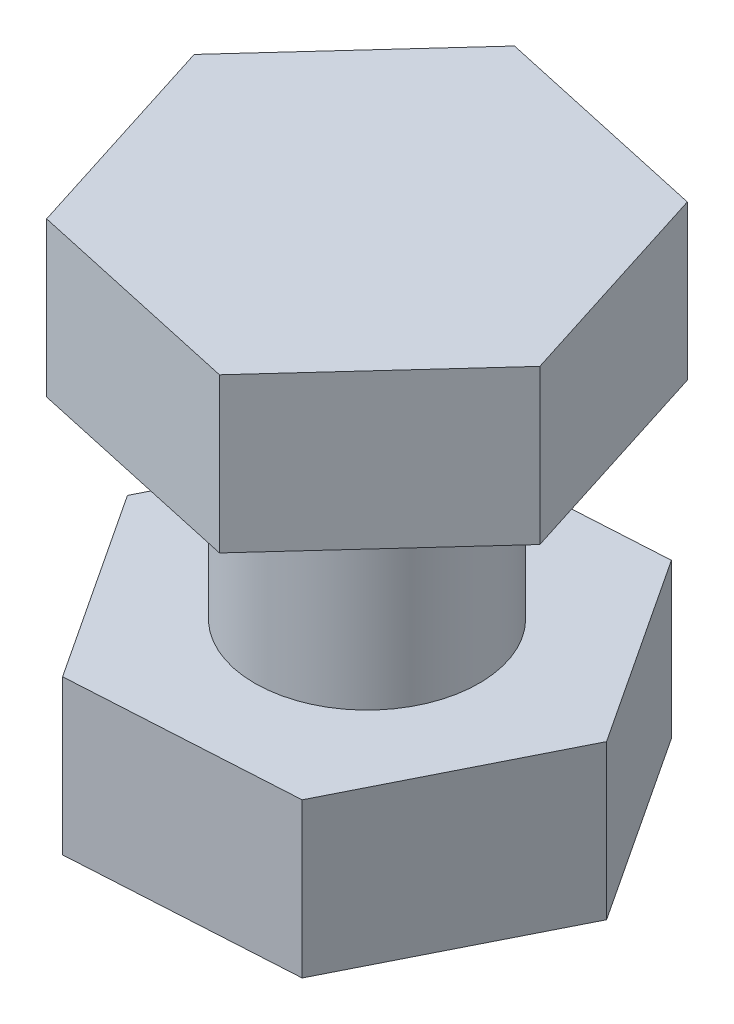
ISO-10303-21;
HEADER;
FILE_DESCRIPTION(('STEP AP214'),'2;1');
FILE_NAME('part.step','',(''),(''),'','','');
FILE_SCHEMA(('AUTOMOTIVE_DESIGN { 1 0 10303 214 1 1 1 1 }'));
ENDSEC;
DATA;
#1=APPLICATION_CONTEXT('core data for automotive mechanical design processes');
#2=APPLICATION_PROTOCOL_DEFINITION('international standard','automotive_design',2000,#1);
#3=PRODUCT_CONTEXT('',#1,'mechanical');
#4=PRODUCT('Part','Part','',(#3));
#5=PRODUCT_RELATED_PRODUCT_CATEGORY('part','',(#4));
#6=PRODUCT_DEFINITION_FORMATION('','',#4);
#7=PRODUCT_DEFINITION_CONTEXT('part definition',#1,'design');
#8=PRODUCT_DEFINITION('design','',#6,#7);
#9=PRODUCT_DEFINITION_SHAPE('','',#8);
#10=(LENGTH_UNIT() NAMED_UNIT(*) SI_UNIT(.MILLI.,.METRE.));
#11=(NAMED_UNIT(*) PLANE_ANGLE_UNIT() SI_UNIT($,.RADIAN.));
#12=(NAMED_UNIT(*) SI_UNIT($,.STERADIAN.) SOLID_ANGLE_UNIT());
#13=UNCERTAINTY_MEASURE_WITH_UNIT(LENGTH_MEASURE(1.E-05),#10,'distance_accuracy_value','');
#14=(GEOMETRIC_REPRESENTATION_CONTEXT(3) GLOBAL_UNCERTAINTY_ASSIGNED_CONTEXT((#13)) GLOBAL_UNIT_ASSIGNED_CONTEXT((#10,
#11,#12)) REPRESENTATION_CONTEXT('',''));
#15=CARTESIAN_POINT('',(0.,0.,0.));
#16=DIRECTION('',(0.,0.,1.));
#17=DIRECTION('',(1.,0.,0.));
#18=AXIS2_PLACEMENT_3D('',#15,#16,#17);
#19=CARTESIAN_POINT('',(0.,10.,0.));
#20=DIRECTION('',(0.,-1.,0.));
#21=DIRECTION('',(0.,0.,-1.));
#22=AXIS2_PLACEMENT_3D('',#19,#20,#21);
#23=CYLINDRICAL_SURFACE('',#22,3.175);
#24=CARTESIAN_POINT('',(0.,0.,0.));
#25=DIRECTION('',(0.,1.,0.));
#26=DIRECTION('',(0.,0.,1.));
#27=AXIS2_PLACEMENT_3D('',#24,#25,#26);
#28=CIRCLE('',#27,3.175);
#29=CARTESIAN_POINT('',(0.,0.,3.175));
#30=VERTEX_POINT('',#29);
#31=EDGE_CURVE('E50',#30,#30,#28,.T.);
#32=ORIENTED_EDGE('',*,*,#31,.T.);
#33=EDGE_LOOP('',(#32));
#34=FACE_BOUND('',#33,.T.);
#35=CARTESIAN_POINT('',(0.,5.634375,0.));
#36=DIRECTION('',(0.,1.,0.));
#37=DIRECTION('',(0.,0.,1.));
#38=AXIS2_PLACEMENT_3D('',#35,#36,#37);
#39=CIRCLE('',#38,3.175);
#40=CARTESIAN_POINT('',(0.,5.634375,3.175));
#41=VERTEX_POINT('',#40);
#42=EDGE_CURVE('E11',#41,#41,#39,.T.);
#43=ORIENTED_EDGE('',*,*,#42,.F.);
#44=EDGE_LOOP('',(#43));
#45=FACE_BOUND('',#44,.T.);
#46=ADVANCED_FACE('F39',(#34,#45),#23,.T.);
#47=CARTESIAN_POINT('',(2.87936518123152,-4.365625,-5.733394128825));
#48=DIRECTION('',(-0.835483710894783,0.,0.549515212555105));
#49=DIRECTION('',(0.549515212555105,0.,0.835483710894783));
#50=AXIS2_PLACEMENT_3D('',#47,#48,#49);
#51=PLANE('',#50);
#52=DIRECTION('',(0.549515212555105,0.,0.835483710894783));
#53=VECTOR('',#52,1.);
#54=CARTESIAN_POINT('',(2.87936518123152,0.,-5.733394128825));
#55=LINE('',#54,#53);
#56=CARTESIAN_POINT('',(2.87936518123152,0.,-5.733394128825));
#57=VERTEX_POINT('',#56);
#58=CARTESIAN_POINT('',(6.40494755608675,0.,-0.373093670693618));
#59=VERTEX_POINT('',#58);
#60=EDGE_CURVE('E126',#57,#59,#55,.T.);
#61=ORIENTED_EDGE('',*,*,#60,.T.);
#62=DIRECTION('',(0.,1.,0.));
#63=VECTOR('',#62,1.);
#64=CARTESIAN_POINT('',(6.40494755608675,-4.365625,-0.373093670693618));
#65=LINE('',#64,#63);
#66=CARTESIAN_POINT('',(6.40494755608675,-4.365625,-0.373093670693618));
#67=VERTEX_POINT('',#66);
#68=EDGE_CURVE('E148',#67,#59,#65,.T.);
#69=ORIENTED_EDGE('',*,*,#68,.F.);
#70=DIRECTION('',(0.549515212555105,0.,0.835483710894783));
#71=VECTOR('',#70,1.);
#72=CARTESIAN_POINT('',(2.87936518123152,-4.365625,-5.733394128825));
#73=LINE('',#72,#71);
#74=CARTESIAN_POINT('',(2.87936518123152,-4.365625,-5.733394128825));
#75=VERTEX_POINT('',#74);
#76=EDGE_CURVE('E140',#75,#67,#73,.T.);
#77=ORIENTED_EDGE('',*,*,#76,.F.);
#78=DIRECTION('',(0.,1.,0.));
#79=VECTOR('',#78,1.);
#80=CARTESIAN_POINT('',(2.87936518123152,-4.365625,-5.733394128825));
#81=LINE('',#80,#79);
#82=EDGE_CURVE('E125',#75,#57,#81,.T.);
#83=ORIENTED_EDGE('',*,*,#82,.T.);
#84=EDGE_LOOP('',(#61,#69,#77,#83));
#85=FACE_BOUND('',#84,.T.);
#86=ADVANCED_FACE('F161',(#85),#51,.F.);
#87=CARTESIAN_POINT('',(6.40494755608675,-4.365625,-0.373093670693618));
#88=DIRECTION('',(-0.893635989286119,0.,-0.448792511805423));
#89=DIRECTION('',(-0.448792511805423,0.,0.893635989286119));
#90=AXIS2_PLACEMENT_3D('',#87,#88,#89);
#91=PLANE('',#90);
#92=DIRECTION('',(-0.448792511805423,0.,0.893635989286118));
#93=VECTOR('',#92,1.);
#94=CARTESIAN_POINT('',(6.40494755608675,0.,-0.373093670693618));
#95=LINE('',#94,#93);
#96=CARTESIAN_POINT('',(3.52558237485523,0.,5.36030045813138));
#97=VERTEX_POINT('',#96);
#98=EDGE_CURVE('E132',#59,#97,#95,.T.);
#99=ORIENTED_EDGE('',*,*,#98,.T.);
#100=DIRECTION('',(0.,1.,0.));
#101=VECTOR('',#100,1.);
#102=CARTESIAN_POINT('',(3.52558237485523,-4.365625,5.36030045813138));
#103=LINE('',#102,#101);
#104=CARTESIAN_POINT('',(3.52558237485523,-4.365625,5.36030045813138));
#105=VERTEX_POINT('',#104);
#106=EDGE_CURVE('E141',#105,#97,#103,.T.);
#107=ORIENTED_EDGE('',*,*,#106,.F.);
#108=DIRECTION('',(-0.448792511805423,0.,0.893635989286118));
#109=VECTOR('',#108,1.);
#110=CARTESIAN_POINT('',(6.40494755608675,-4.365625,-0.373093670693618));
#111=LINE('',#110,#109);
#112=EDGE_CURVE('E94',#67,#105,#111,.T.);
#113=ORIENTED_EDGE('',*,*,#112,.F.);
#114=ORIENTED_EDGE('',*,*,#68,.T.);
#115=EDGE_LOOP('',(#99,#107,#113,#114));
#116=FACE_BOUND('',#115,.T.);
#117=ADVANCED_FACE('F179',(#116),#91,.F.);
#118=CARTESIAN_POINT('',(3.52558237485523,-4.365625,5.36030045813138));
#119=DIRECTION('',(-0.0581522783913356,0.,-0.998307724360528));
#120=DIRECTION('',(-0.998307724360528,0.,0.0581522783913356));
#121=AXIS2_PLACEMENT_3D('',#118,#119,#120);
#122=PLANE('',#121);
#123=DIRECTION('',(-0.998307724360528,0.,0.0581522783913356));
#124=VECTOR('',#123,1.);
#125=CARTESIAN_POINT('',(3.52558237485523,0.,5.36030045813138));
#126=LINE('',#125,#124);
#127=CARTESIAN_POINT('',(-2.87936518123152,0.,5.733394128825));
#128=VERTEX_POINT('',#127);
#129=EDGE_CURVE('E131',#97,#128,#126,.T.);
#130=ORIENTED_EDGE('',*,*,#129,.T.);
#131=DIRECTION('',(0.,1.,0.));
#132=VECTOR('',#131,1.);
#133=CARTESIAN_POINT('',(-2.87936518123152,-4.365625,5.733394128825));
#134=LINE('',#133,#132);
#135=CARTESIAN_POINT('',(-2.87936518123152,-4.365625,5.733394128825));
#136=VERTEX_POINT('',#135);
#137=EDGE_CURVE('E116',#136,#128,#134,.T.);
#138=ORIENTED_EDGE('',*,*,#137,.F.);
#139=DIRECTION('',(-0.998307724360528,0.,0.0581522783913356));
#140=VECTOR('',#139,1.);
#141=CARTESIAN_POINT('',(3.52558237485523,-4.365625,5.36030045813138));
#142=LINE('',#141,#140);
#143=EDGE_CURVE('E109',#105,#136,#142,.T.);
#144=ORIENTED_EDGE('',*,*,#143,.F.);
#145=ORIENTED_EDGE('',*,*,#106,.T.);
#146=EDGE_LOOP('',(#130,#138,#144,#145));
#147=FACE_BOUND('',#146,.T.);
#148=ADVANCED_FACE('F185',(#147),#122,.F.);
#149=CARTESIAN_POINT('',(-2.87936518123152,-4.365625,5.733394128825));
#150=DIRECTION('',(0.835483710894783,0.,-0.549515212555106));
#151=DIRECTION('',(-0.549515212555106,0.,-0.835483710894783));
#152=AXIS2_PLACEMENT_3D('',#149,#150,#151);
#153=PLANE('',#152);
#154=DIRECTION('',(-0.549515212555106,0.,-0.835483710894783));
#155=VECTOR('',#154,1.);
#156=CARTESIAN_POINT('',(-2.87936518123152,0.,5.733394128825));
#157=LINE('',#156,#155);
#158=CARTESIAN_POINT('',(-6.40494755608676,0.,0.373093670693618));
#159=VERTEX_POINT('',#158);
#160=EDGE_CURVE('E119',#128,#159,#157,.T.);
#161=ORIENTED_EDGE('',*,*,#160,.T.);
#162=DIRECTION('',(0.,1.,0.));
#163=VECTOR('',#162,1.);
#164=CARTESIAN_POINT('',(-6.40494755608676,-4.365625,0.373093670693618));
#165=LINE('',#164,#163);
#166=CARTESIAN_POINT('',(-6.40494755608676,-4.365625,0.373093670693618));
#167=VERTEX_POINT('',#166);
#168=EDGE_CURVE('E113',#167,#159,#165,.T.);
#169=ORIENTED_EDGE('',*,*,#168,.F.);
#170=DIRECTION('',(-0.549515212555106,0.,-0.835483710894783));
#171=VECTOR('',#170,1.);
#172=CARTESIAN_POINT('',(-2.87936518123152,-4.365625,5.733394128825));
#173=LINE('',#172,#171);
#174=EDGE_CURVE('E102',#136,#167,#173,.T.);
#175=ORIENTED_EDGE('',*,*,#174,.F.);
#176=ORIENTED_EDGE('',*,*,#137,.T.);
#177=EDGE_LOOP('',(#161,#169,#175,#176));
#178=FACE_BOUND('',#177,.T.);
#179=ADVANCED_FACE('F117',(#178),#153,.F.);
#180=CARTESIAN_POINT('',(-6.40494755608676,-4.365625,0.373093670693618));
#181=DIRECTION('',(0.893635989286119,0.,0.448792511805423));
#182=DIRECTION('',(0.448792511805423,0.,-0.893635989286119));
#183=AXIS2_PLACEMENT_3D('',#180,#181,#182);
#184=PLANE('',#183);
#185=DIRECTION('',(0.448792511805423,0.,-0.893635989286118));
#186=VECTOR('',#185,1.);
#187=CARTESIAN_POINT('',(-6.40494755608676,0.,0.373093670693618));
#188=LINE('',#187,#186);
#189=CARTESIAN_POINT('',(-3.52558237485524,0.,-5.36030045813138));
#190=VERTEX_POINT('',#189);
#191=EDGE_CURVE('E76',#159,#190,#188,.T.);
#192=ORIENTED_EDGE('',*,*,#191,.T.);
#193=DIRECTION('',(0.,1.,0.));
#194=VECTOR('',#193,1.);
#195=CARTESIAN_POINT('',(-3.52558237485524,-4.365625,-5.36030045813138));
#196=LINE('',#195,#194);
#197=CARTESIAN_POINT('',(-3.52558237485524,-4.365625,-5.36030045813138));
#198=VERTEX_POINT('',#197);
#199=EDGE_CURVE('E118',#198,#190,#196,.T.);
#200=ORIENTED_EDGE('',*,*,#199,.F.);
#201=DIRECTION('',(0.448792511805423,0.,-0.893635989286118));
#202=VECTOR('',#201,1.);
#203=CARTESIAN_POINT('',(-6.40494755608676,-4.365625,0.373093670693618));
#204=LINE('',#203,#202);
#205=EDGE_CURVE('E107',#167,#198,#204,.T.);
#206=ORIENTED_EDGE('',*,*,#205,.F.);
#207=ORIENTED_EDGE('',*,*,#168,.T.);
#208=EDGE_LOOP('',(#192,#200,#206,#207));
#209=FACE_BOUND('',#208,.T.);
#210=ADVANCED_FACE('F124',(#209),#184,.F.);
#211=CARTESIAN_POINT('',(-3.52558237485524,-4.365625,-5.36030045813138));
#212=DIRECTION('',(0.0581522783913359,0.,0.998307724360528));
#213=DIRECTION('',(0.998307724360528,0.,-0.0581522783913359));
#214=AXIS2_PLACEMENT_3D('',#211,#212,#213);
#215=PLANE('',#214);
#216=DIRECTION('',(0.998307724360528,0.,-0.0581522783913359));
#217=VECTOR('',#216,1.);
#218=CARTESIAN_POINT('',(-3.52558237485524,0.,-5.36030045813138));
#219=LINE('',#218,#217);
#220=EDGE_CURVE('E81',#190,#57,#219,.T.);
#221=ORIENTED_EDGE('',*,*,#220,.T.);
#222=ORIENTED_EDGE('',*,*,#82,.F.);
#223=DIRECTION('',(0.998307724360528,0.,-0.0581522783913359));
#224=VECTOR('',#223,1.);
#225=CARTESIAN_POINT('',(-3.52558237485524,-4.365625,-5.36030045813138));
#226=LINE('',#225,#224);
#227=EDGE_CURVE('E54',#198,#75,#226,.T.);
#228=ORIENTED_EDGE('',*,*,#227,.F.);
#229=ORIENTED_EDGE('',*,*,#199,.T.);
#230=EDGE_LOOP('',(#221,#222,#228,#229));
#231=FACE_BOUND('',#230,.T.);
#232=ADVANCED_FACE('F162',(#231),#215,.F.);
#233=CARTESIAN_POINT('',(0.,-4.365625,0.));
#234=DIRECTION('',(0.,-1.,0.));
#235=DIRECTION('',(0.,0.,-1.));
#236=AXIS2_PLACEMENT_3D('',#233,#234,#235);
#237=PLANE('',#236);
#238=ORIENTED_EDGE('',*,*,#76,.T.);
#239=ORIENTED_EDGE('',*,*,#112,.T.);
#240=ORIENTED_EDGE('',*,*,#143,.T.);
#241=ORIENTED_EDGE('',*,*,#174,.T.);
#242=ORIENTED_EDGE('',*,*,#205,.T.);
#243=ORIENTED_EDGE('',*,*,#227,.T.);
#244=EDGE_LOOP('',(#238,#239,#240,#241,#242,#243));
#245=FACE_BOUND('',#244,.T.);
#246=ADVANCED_FACE('F106',(#245),#237,.T.);
#247=CARTESIAN_POINT('',(0.,0.,0.));
#248=DIRECTION('',(0.,-1.,0.));
#249=DIRECTION('',(0.,0.,-1.));
#250=AXIS2_PLACEMENT_3D('',#247,#248,#249);
#251=PLANE('',#250);
#252=ORIENTED_EDGE('',*,*,#31,.F.);
#253=EDGE_LOOP('',(#252));
#254=FACE_BOUND('',#253,.T.);
#255=ORIENTED_EDGE('',*,*,#60,.F.);
#256=ORIENTED_EDGE('',*,*,#220,.F.);
#257=ORIENTED_EDGE('',*,*,#191,.F.);
#258=ORIENTED_EDGE('',*,*,#160,.F.);
#259=ORIENTED_EDGE('',*,*,#129,.F.);
#260=ORIENTED_EDGE('',*,*,#98,.F.);
#261=EDGE_LOOP('',(#255,#256,#257,#258,#259,#260));
#262=FACE_BOUND('',#261,.T.);
#263=ADVANCED_FACE('F155',(#254,#262),#251,.F.);
#264=CARTESIAN_POINT('',(-1.94159403150196,5.634375,-6.11496236293972));
#265=DIRECTION('',(-0.738637012080491,0.,-0.674103378114073));
#266=DIRECTION('',(-0.674103378114073,0.,0.738637012080491));
#267=AXIS2_PLACEMENT_3D('',#264,#265,#266);
#268=PLANE('',#267);
#269=DIRECTION('',(-0.674103378114073,0.,0.738637012080491));
#270=VECTOR('',#269,1.);
#271=CARTESIAN_POINT('',(-1.94159403150196,10.,-6.11496236293972));
#272=LINE('',#271,#270);
#273=CARTESIAN_POINT('',(-1.94159403150196,10.,-6.11496236293972));
#274=VERTEX_POINT('',#273);
#275=CARTESIAN_POINT('',(-6.26650976524249,10.,-1.37601142635292));
#276=VERTEX_POINT('',#275);
#277=EDGE_CURVE('E199',#274,#276,#272,.T.);
#278=ORIENTED_EDGE('',*,*,#277,.F.);
#279=DIRECTION('',(0.,1.,0.));
#280=VECTOR('',#279,1.);
#281=CARTESIAN_POINT('',(-1.94159403150196,5.634375,-6.11496236293972));
#282=LINE('',#281,#280);
#283=CARTESIAN_POINT('',(-1.94159403150196,5.634375,-6.11496236293972));
#284=VERTEX_POINT('',#283);
#285=EDGE_CURVE('E135',#284,#274,#282,.T.);
#286=ORIENTED_EDGE('',*,*,#285,.F.);
#287=DIRECTION('',(-0.674103378114073,0.,0.738637012080491));
#288=VECTOR('',#287,1.);
#289=CARTESIAN_POINT('',(-1.94159403150196,5.634375,-6.11496236293972));
#290=LINE('',#289,#288);
#291=CARTESIAN_POINT('',(-6.26650976524249,5.634375,-1.37601142635292));
#292=VERTEX_POINT('',#291);
#293=EDGE_CURVE('E227',#284,#292,#290,.T.);
#294=ORIENTED_EDGE('',*,*,#293,.T.);
#295=DIRECTION('',(0.,1.,0.));
#296=VECTOR('',#295,1.);
#297=CARTESIAN_POINT('',(-6.26650976524249,5.634375,-1.37601142635292));
#298=LINE('',#297,#296);
#299=EDGE_CURVE('E242',#292,#276,#298,.T.);
#300=ORIENTED_EDGE('',*,*,#299,.T.);
#301=EDGE_LOOP('',(#278,#286,#294,#300));
#302=FACE_BOUND('',#301,.T.);
#303=ADVANCED_FACE('F154',(#302),#268,.T.);
#304=CARTESIAN_POINT('',(4.32491573374053,5.634375,-4.7389509365868));
#305=DIRECTION('',(0.214472144183448,0.,-0.976730105694175));
#306=DIRECTION('',(-0.976730105694175,0.,-0.214472144183448));
#307=AXIS2_PLACEMENT_3D('',#304,#305,#306);
#308=PLANE('',#307);
#309=DIRECTION('',(-0.976730105694175,0.,-0.214472144183448));
#310=VECTOR('',#309,1.);
#311=CARTESIAN_POINT('',(4.32491573374053,10.,-4.7389509365868));
#312=LINE('',#311,#310);
#313=CARTESIAN_POINT('',(4.32491573374053,10.,-4.7389509365868));
#314=VERTEX_POINT('',#313);
#315=EDGE_CURVE('E210',#314,#274,#312,.T.);
#316=ORIENTED_EDGE('',*,*,#315,.F.);
#317=DIRECTION('',(0.,1.,0.));
#318=VECTOR('',#317,1.);
#319=CARTESIAN_POINT('',(4.32491573374053,5.634375,-4.7389509365868));
#320=LINE('',#319,#318);
#321=CARTESIAN_POINT('',(4.32491573374053,5.634375,-4.7389509365868));
#322=VERTEX_POINT('',#321);
#323=EDGE_CURVE('E226',#322,#314,#320,.T.);
#324=ORIENTED_EDGE('',*,*,#323,.F.);
#325=DIRECTION('',(-0.976730105694175,0.,-0.214472144183448));
#326=VECTOR('',#325,1.);
#327=CARTESIAN_POINT('',(4.32491573374053,5.634375,-4.7389509365868));
#328=LINE('',#327,#326);
#329=EDGE_CURVE('E216',#322,#284,#328,.T.);
#330=ORIENTED_EDGE('',*,*,#329,.T.);
#331=ORIENTED_EDGE('',*,*,#285,.T.);
#332=EDGE_LOOP('',(#316,#324,#330,#331));
#333=FACE_BOUND('',#332,.T.);
#334=ADVANCED_FACE('F288',(#333),#308,.T.);
#335=CARTESIAN_POINT('',(6.2665097652425,5.634375,1.37601142635292));
#336=DIRECTION('',(0.953109156263939,0.,-0.302626727580103));
#337=DIRECTION('',(-0.302626727580103,0.,-0.953109156263939));
#338=AXIS2_PLACEMENT_3D('',#335,#336,#337);
#339=PLANE('',#338);
#340=DIRECTION('',(-0.302626727580103,0.,-0.953109156263939));
#341=VECTOR('',#340,1.);
#342=CARTESIAN_POINT('',(6.2665097652425,10.,1.37601142635292));
#343=LINE('',#342,#341);
#344=CARTESIAN_POINT('',(6.2665097652425,10.,1.37601142635292));
#345=VERTEX_POINT('',#344);
#346=EDGE_CURVE('E224',#345,#314,#343,.T.);
#347=ORIENTED_EDGE('',*,*,#346,.F.);
#348=DIRECTION('',(0.,1.,0.));
#349=VECTOR('',#348,1.);
#350=CARTESIAN_POINT('',(6.2665097652425,5.634375,1.37601142635292));
#351=LINE('',#350,#349);
#352=CARTESIAN_POINT('',(6.2665097652425,5.634375,1.37601142635292));
#353=VERTEX_POINT('',#352);
#354=EDGE_CURVE('E234',#353,#345,#351,.T.);
#355=ORIENTED_EDGE('',*,*,#354,.F.);
#356=DIRECTION('',(-0.302626727580103,0.,-0.953109156263939));
#357=VECTOR('',#356,1.);
#358=CARTESIAN_POINT('',(6.2665097652425,5.634375,1.37601142635292));
#359=LINE('',#358,#357);
#360=EDGE_CURVE('E401',#353,#322,#359,.T.);
#361=ORIENTED_EDGE('',*,*,#360,.T.);
#362=ORIENTED_EDGE('',*,*,#323,.T.);
#363=EDGE_LOOP('',(#347,#355,#361,#362));
#364=FACE_BOUND('',#363,.T.);
#365=ADVANCED_FACE('F293',(#364),#339,.T.);
#366=CARTESIAN_POINT('',(1.94159403150197,5.634375,6.11496236293971));
#367=DIRECTION('',(0.738637012080491,0.,0.674103378114073));
#368=DIRECTION('',(0.674103378114073,0.,-0.738637012080491));
#369=AXIS2_PLACEMENT_3D('',#366,#367,#368);
#370=PLANE('',#369);
#371=DIRECTION('',(0.674103378114073,0.,-0.738637012080491));
#372=VECTOR('',#371,1.);
#373=CARTESIAN_POINT('',(1.94159403150197,10.,6.11496236293971));
#374=LINE('',#373,#372);
#375=CARTESIAN_POINT('',(1.94159403150197,10.,6.11496236293971));
#376=VERTEX_POINT('',#375);
#377=EDGE_CURVE('E219',#376,#345,#374,.T.);
#378=ORIENTED_EDGE('',*,*,#377,.F.);
#379=DIRECTION('',(0.,1.,0.));
#380=VECTOR('',#379,1.);
#381=CARTESIAN_POINT('',(1.94159403150197,5.634375,6.11496236293971));
#382=LINE('',#381,#380);
#383=CARTESIAN_POINT('',(1.94159403150197,5.634375,6.11496236293971));
#384=VERTEX_POINT('',#383);
#385=EDGE_CURVE('E231',#384,#376,#382,.T.);
#386=ORIENTED_EDGE('',*,*,#385,.F.);
#387=DIRECTION('',(0.674103378114073,0.,-0.738637012080491));
#388=VECTOR('',#387,1.);
#389=CARTESIAN_POINT('',(1.94159403150197,5.634375,6.11496236293971));
#390=LINE('',#389,#388);
#391=EDGE_CURVE('E404',#384,#353,#390,.T.);
#392=ORIENTED_EDGE('',*,*,#391,.T.);
#393=ORIENTED_EDGE('',*,*,#354,.T.);
#394=EDGE_LOOP('',(#378,#386,#392,#393));
#395=FACE_BOUND('',#394,.T.);
#396=ADVANCED_FACE('F301',(#395),#370,.T.);
#397=CARTESIAN_POINT('',(-4.32491573374053,5.634375,4.7389509365868));
#398=DIRECTION('',(-0.214472144183448,0.,0.976730105694175));
#399=DIRECTION('',(0.976730105694175,0.,0.214472144183448));
#400=AXIS2_PLACEMENT_3D('',#397,#398,#399);
#401=PLANE('',#400);
#402=DIRECTION('',(0.976730105694175,0.,0.214472144183448));
#403=VECTOR('',#402,1.);
#404=CARTESIAN_POINT('',(-4.32491573374053,10.,4.7389509365868));
#405=LINE('',#404,#403);
#406=CARTESIAN_POINT('',(-4.32491573374053,10.,4.7389509365868));
#407=VERTEX_POINT('',#406);
#408=EDGE_CURVE('E213',#407,#376,#405,.T.);
#409=ORIENTED_EDGE('',*,*,#408,.F.);
#410=DIRECTION('',(0.,1.,0.));
#411=VECTOR('',#410,1.);
#412=CARTESIAN_POINT('',(-4.32491573374053,5.634375,4.7389509365868));
#413=LINE('',#412,#411);
#414=CARTESIAN_POINT('',(-4.32491573374053,5.634375,4.7389509365868));
#415=VERTEX_POINT('',#414);
#416=EDGE_CURVE('E236',#415,#407,#413,.T.);
#417=ORIENTED_EDGE('',*,*,#416,.F.);
#418=DIRECTION('',(0.976730105694175,0.,0.214472144183448));
#419=VECTOR('',#418,1.);
#420=CARTESIAN_POINT('',(-4.32491573374053,5.634375,4.7389509365868));
#421=LINE('',#420,#419);
#422=EDGE_CURVE('E407',#415,#384,#421,.T.);
#423=ORIENTED_EDGE('',*,*,#422,.T.);
#424=ORIENTED_EDGE('',*,*,#385,.T.);
#425=EDGE_LOOP('',(#409,#417,#423,#424));
#426=FACE_BOUND('',#425,.T.);
#427=ADVANCED_FACE('F312',(#426),#401,.T.);
#428=CARTESIAN_POINT('',(-6.26650976524249,5.634375,-1.37601142635292));
#429=DIRECTION('',(-0.953109156263939,0.,0.302626727580102));
#430=DIRECTION('',(0.302626727580102,0.,0.953109156263939));
#431=AXIS2_PLACEMENT_3D('',#428,#429,#430);
#432=PLANE('',#431);
#433=DIRECTION('',(0.302626727580102,0.,0.953109156263939));
#434=VECTOR('',#433,1.);
#435=CARTESIAN_POINT('',(-6.26650976524249,10.,-1.37601142635292));
#436=LINE('',#435,#434);
#437=EDGE_CURVE('E204',#276,#407,#436,.T.);
#438=ORIENTED_EDGE('',*,*,#437,.F.);
#439=ORIENTED_EDGE('',*,*,#299,.F.);
#440=DIRECTION('',(0.302626727580102,0.,0.953109156263939));
#441=VECTOR('',#440,1.);
#442=CARTESIAN_POINT('',(-6.26650976524249,5.634375,-1.37601142635292));
#443=LINE('',#442,#441);
#444=EDGE_CURVE('E375',#292,#415,#443,.T.);
#445=ORIENTED_EDGE('',*,*,#444,.T.);
#446=ORIENTED_EDGE('',*,*,#416,.T.);
#447=EDGE_LOOP('',(#438,#439,#445,#446));
#448=FACE_BOUND('',#447,.T.);
#449=ADVANCED_FACE('F194',(#448),#432,.T.);
#450=CARTESIAN_POINT('',(0.,5.634375,0.));
#451=DIRECTION('',(0.,1.,0.));
#452=DIRECTION('',(0.,0.,1.));
#453=AXIS2_PLACEMENT_3D('',#450,#451,#452);
#454=PLANE('',#453);
#455=ORIENTED_EDGE('',*,*,#42,.T.);
#456=EDGE_LOOP('',(#455));
#457=FACE_BOUND('',#456,.T.);
#458=ORIENTED_EDGE('',*,*,#293,.F.);
#459=ORIENTED_EDGE('',*,*,#329,.F.);
#460=ORIENTED_EDGE('',*,*,#360,.F.);
#461=ORIENTED_EDGE('',*,*,#391,.F.);
#462=ORIENTED_EDGE('',*,*,#422,.F.);
#463=ORIENTED_EDGE('',*,*,#444,.F.);
#464=EDGE_LOOP('',(#458,#459,#460,#461,#462,#463));
#465=FACE_BOUND('',#464,.T.);
#466=ADVANCED_FACE('F190',(#457,#465),#454,.F.);
#467=CARTESIAN_POINT('',(0.,10.,0.));
#468=DIRECTION('',(0.,1.,0.));
#469=DIRECTION('',(0.,0.,1.));
#470=AXIS2_PLACEMENT_3D('',#467,#468,#469);
#471=PLANE('',#470);
#472=ORIENTED_EDGE('',*,*,#277,.T.);
#473=ORIENTED_EDGE('',*,*,#437,.T.);
#474=ORIENTED_EDGE('',*,*,#408,.T.);
#475=ORIENTED_EDGE('',*,*,#377,.T.);
#476=ORIENTED_EDGE('',*,*,#346,.T.);
#477=ORIENTED_EDGE('',*,*,#315,.T.);
#478=EDGE_LOOP('',(#472,#473,#474,#475,#476,#477));
#479=FACE_BOUND('',#478,.T.);
#480=ADVANCED_FACE('F183',(#479),#471,.T.);
#481=CLOSED_SHELL('',(#46,#86,#117,#148,#179,#210,#232,#246,#263,#303,#334,#365,#396,#427,#449,
#466,#480));
#482=MANIFOLD_SOLID_BREP('B2',#481);
#483=ADVANCED_BREP_SHAPE_REPRESENTATION('',(#18,#482),#14);
#484=SHAPE_DEFINITION_REPRESENTATION(#9,#483);
ENDSEC;
END-ISO-10303-21;
